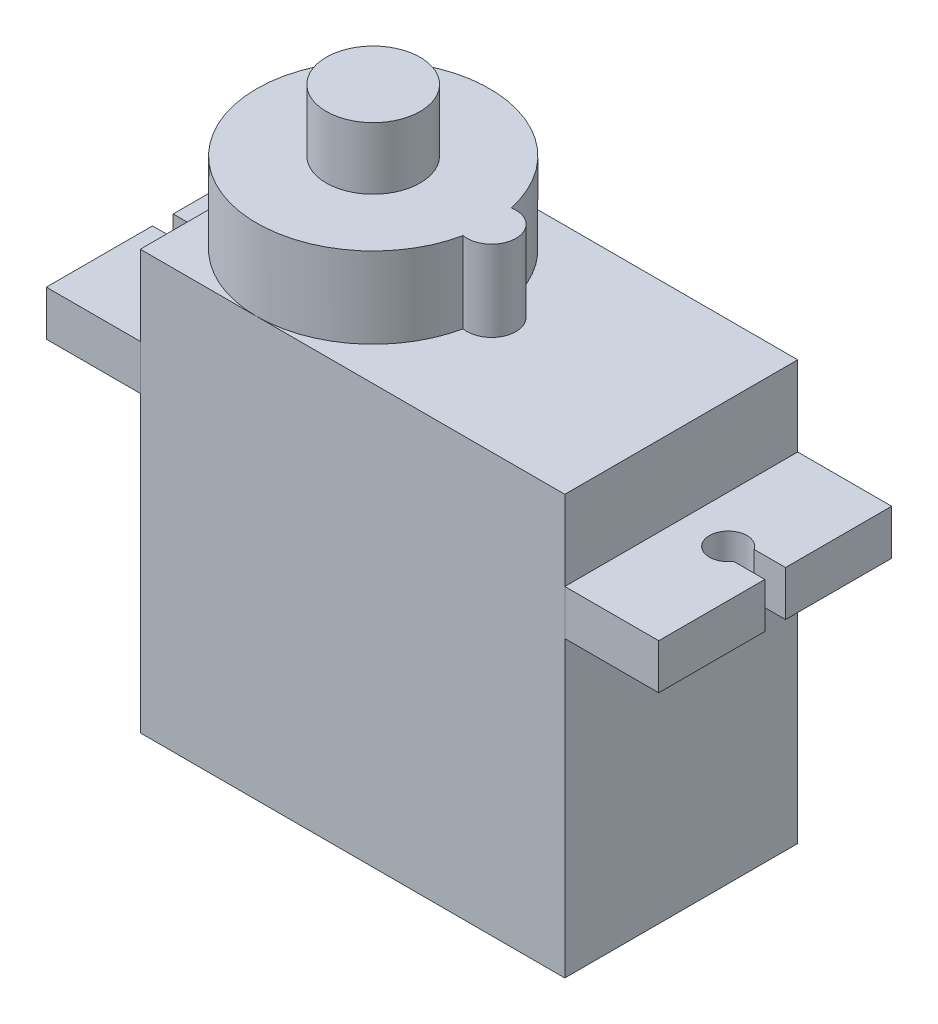
ISO-10303-21;
HEADER;
FILE_DESCRIPTION(('STEP AP214'),'2;1');
FILE_NAME('part.step','',(''),(''),'','','');
FILE_SCHEMA(('AUTOMOTIVE_DESIGN { 1 0 10303 214 1 1 1 1 }'));
ENDSEC;
DATA;
#1=APPLICATION_CONTEXT('core data for automotive mechanical design processes');
#2=APPLICATION_PROTOCOL_DEFINITION('international standard','automotive_design',2000,#1);
#3=PRODUCT_CONTEXT('',#1,'mechanical');
#4=PRODUCT('Part','Part','',(#3));
#5=PRODUCT_RELATED_PRODUCT_CATEGORY('part','',(#4));
#6=PRODUCT_DEFINITION_FORMATION('','',#4);
#7=PRODUCT_DEFINITION_CONTEXT('part definition',#1,'design');
#8=PRODUCT_DEFINITION('design','',#6,#7);
#9=PRODUCT_DEFINITION_SHAPE('','',#8);
#10=(LENGTH_UNIT() NAMED_UNIT(*) SI_UNIT(.MILLI.,.METRE.));
#11=(NAMED_UNIT(*) PLANE_ANGLE_UNIT() SI_UNIT($,.RADIAN.));
#12=(NAMED_UNIT(*) SI_UNIT($,.STERADIAN.) SOLID_ANGLE_UNIT());
#13=UNCERTAINTY_MEASURE_WITH_UNIT(LENGTH_MEASURE(1.E-05),#10,'distance_accuracy_value','');
#14=(GEOMETRIC_REPRESENTATION_CONTEXT(3) GLOBAL_UNCERTAINTY_ASSIGNED_CONTEXT((#13)) GLOBAL_UNIT_ASSIGNED_CONTEXT((#10,
#11,#12)) REPRESENTATION_CONTEXT('',''));
#15=CARTESIAN_POINT('',(0.,0.,0.));
#16=DIRECTION('',(0.,0.,1.));
#17=DIRECTION('',(1.,0.,0.));
#18=AXIS2_PLACEMENT_3D('',#15,#16,#17);
#19=CARTESIAN_POINT('',(-13.6,4.5,1.2));
#20=DIRECTION('',(1.,0.,0.));
#21=DIRECTION('',(0.,0.,-1.));
#22=AXIS2_PLACEMENT_3D('',#19,#20,#21);
#23=CYLINDRICAL_SURFACE('',#22,0.6);
#24=CARTESIAN_POINT('',(-13.6,4.5,1.2));
#25=DIRECTION('',(-1.,0.,0.));
#26=DIRECTION('',(0.,0.,1.));
#27=AXIS2_PLACEMENT_3D('',#24,#25,#26);
#28=CIRCLE('',#27,0.6);
#29=CARTESIAN_POINT('',(-13.6,4.5,1.8));
#30=VERTEX_POINT('',#29);
#31=EDGE_CURVE('E12',#30,#30,#28,.T.);
#32=ORIENTED_EDGE('',*,*,#31,.F.);
#33=EDGE_LOOP('',(#32));
#34=FACE_BOUND('',#33,.T.);
#35=CARTESIAN_POINT('',(-11.3,4.5,1.2));
#36=DIRECTION('',(-1.,0.,0.));
#37=DIRECTION('',(0.,0.,1.));
#38=AXIS2_PLACEMENT_3D('',#35,#36,#37);
#39=CIRCLE('',#38,0.6);
#40=CARTESIAN_POINT('',(-11.3,4.5,1.8));
#41=VERTEX_POINT('',#40);
#42=EDGE_CURVE('E53',#41,#41,#39,.T.);
#43=ORIENTED_EDGE('',*,*,#42,.T.);
#44=EDGE_LOOP('',(#43));
#45=FACE_BOUND('',#44,.T.);
#46=ADVANCED_FACE('F50',(#34,#45),#23,.T.);
#47=CARTESIAN_POINT('',(-13.6,0.,0.));
#48=DIRECTION('',(-1.,0.,0.));
#49=DIRECTION('',(0.,0.,1.));
#50=AXIS2_PLACEMENT_3D('',#47,#48,#49);
#51=PLANE('',#50);
#52=ORIENTED_EDGE('',*,*,#31,.T.);
#53=EDGE_LOOP('',(#52));
#54=FACE_BOUND('',#53,.T.);
#55=ADVANCED_FACE('F65',(#54),#51,.T.);
#56=CARTESIAN_POINT('',(-11.3,0.,0.));
#57=DIRECTION('',(-1.,0.,0.));
#58=DIRECTION('',(0.,0.,1.));
#59=AXIS2_PLACEMENT_3D('',#56,#57,#58);
#60=PLANE('',#59);
#61=ORIENTED_EDGE('',*,*,#42,.F.);
#62=EDGE_LOOP('',(#61));
#63=FACE_BOUND('',#62,.T.);
#64=ADVANCED_FACE('F63',(#63),#60,.F.);
#65=CLOSED_SHELL('',(#46,#55,#64));
#66=MANIFOLD_SOLID_BREP('B2',#65);
#67=CARTESIAN_POINT('',(-13.6,4.5,-1.2));
#68=DIRECTION('',(1.,0.,0.));
#69=DIRECTION('',(0.,0.,-1.));
#70=AXIS2_PLACEMENT_3D('',#67,#68,#69);
#71=CYLINDRICAL_SURFACE('',#70,0.6);
#72=CARTESIAN_POINT('',(-13.6,4.5,-1.2));
#73=DIRECTION('',(-1.,0.,0.));
#74=DIRECTION('',(0.,0.,1.));
#75=AXIS2_PLACEMENT_3D('',#72,#73,#74);
#76=CIRCLE('',#75,0.6);
#77=CARTESIAN_POINT('',(-13.6,4.5,-0.600000000000001));
#78=VERTEX_POINT('',#77);
#79=EDGE_CURVE('E49',#78,#78,#76,.T.);
#80=ORIENTED_EDGE('',*,*,#79,.F.);
#81=EDGE_LOOP('',(#80));
#82=FACE_BOUND('',#81,.T.);
#83=CARTESIAN_POINT('',(-11.3,4.5,-1.2));
#84=DIRECTION('',(-1.,0.,0.));
#85=DIRECTION('',(0.,0.,1.));
#86=AXIS2_PLACEMENT_3D('',#83,#84,#85);
#87=CIRCLE('',#86,0.6);
#88=CARTESIAN_POINT('',(-11.3,4.5,-0.600000000000001));
#89=VERTEX_POINT('',#88);
#90=EDGE_CURVE('E106',#89,#89,#87,.T.);
#91=ORIENTED_EDGE('',*,*,#90,.T.);
#92=EDGE_LOOP('',(#91));
#93=FACE_BOUND('',#92,.T.);
#94=ADVANCED_FACE('F103',(#82,#93),#71,.T.);
#95=CARTESIAN_POINT('',(-13.6,0.,0.));
#96=DIRECTION('',(-1.,0.,0.));
#97=DIRECTION('',(0.,0.,1.));
#98=AXIS2_PLACEMENT_3D('',#95,#96,#97);
#99=PLANE('',#98);
#100=ORIENTED_EDGE('',*,*,#79,.T.);
#101=EDGE_LOOP('',(#100));
#102=FACE_BOUND('',#101,.T.);
#103=ADVANCED_FACE('F118',(#102),#99,.T.);
#104=CARTESIAN_POINT('',(-11.3,0.,0.));
#105=DIRECTION('',(-1.,0.,0.));
#106=DIRECTION('',(0.,0.,1.));
#107=AXIS2_PLACEMENT_3D('',#104,#105,#106);
#108=PLANE('',#107);
#109=ORIENTED_EDGE('',*,*,#90,.F.);
#110=EDGE_LOOP('',(#109));
#111=FACE_BOUND('',#110,.T.);
#112=ADVANCED_FACE('F116',(#111),#108,.F.);
#113=CLOSED_SHELL('',(#94,#103,#112));
#114=MANIFOLD_SOLID_BREP('B7',#113);
#115=CARTESIAN_POINT('',(-13.6,4.5,0.));
#116=DIRECTION('',(1.,0.,0.));
#117=DIRECTION('',(0.,0.,-1.));
#118=AXIS2_PLACEMENT_3D('',#115,#116,#117);
#119=CYLINDRICAL_SURFACE('',#118,0.6);
#120=CARTESIAN_POINT('',(-13.6,4.5,0.));
#121=DIRECTION('',(-1.,0.,0.));
#122=DIRECTION('',(0.,0.,1.));
#123=AXIS2_PLACEMENT_3D('',#120,#121,#122);
#124=CIRCLE('',#123,0.6);
#125=CARTESIAN_POINT('',(-13.6,4.5,0.599999999999999));
#126=VERTEX_POINT('',#125);
#127=EDGE_CURVE('E102',#126,#126,#124,.T.);
#128=ORIENTED_EDGE('',*,*,#127,.F.);
#129=EDGE_LOOP('',(#128));
#130=FACE_BOUND('',#129,.T.);
#131=CARTESIAN_POINT('',(-11.3,4.5,0.));
#132=DIRECTION('',(-1.,0.,0.));
#133=DIRECTION('',(0.,0.,1.));
#134=AXIS2_PLACEMENT_3D('',#131,#132,#133);
#135=CIRCLE('',#134,0.6);
#136=CARTESIAN_POINT('',(-11.3,4.5,0.599999999999999));
#137=VERTEX_POINT('',#136);
#138=EDGE_CURVE('E161',#137,#137,#135,.T.);
#139=ORIENTED_EDGE('',*,*,#138,.T.);
#140=EDGE_LOOP('',(#139));
#141=FACE_BOUND('',#140,.T.);
#142=ADVANCED_FACE('F158',(#130,#141),#119,.T.);
#143=CARTESIAN_POINT('',(-13.6,0.,0.));
#144=DIRECTION('',(-1.,0.,0.));
#145=DIRECTION('',(0.,0.,1.));
#146=AXIS2_PLACEMENT_3D('',#143,#144,#145);
#147=PLANE('',#146);
#148=ORIENTED_EDGE('',*,*,#127,.T.);
#149=EDGE_LOOP('',(#148));
#150=FACE_BOUND('',#149,.T.);
#151=ADVANCED_FACE('F173',(#150),#147,.T.);
#152=CARTESIAN_POINT('',(-11.3,0.,0.));
#153=DIRECTION('',(-1.,0.,0.));
#154=DIRECTION('',(0.,0.,1.));
#155=AXIS2_PLACEMENT_3D('',#152,#153,#154);
#156=PLANE('',#155);
#157=ORIENTED_EDGE('',*,*,#138,.F.);
#158=EDGE_LOOP('',(#157));
#159=FACE_BOUND('',#158,.T.);
#160=ADVANCED_FACE('F171',(#159),#156,.F.);
#161=CLOSED_SHELL('',(#142,#151,#160));
#162=MANIFOLD_SOLID_BREP('B44',#161);
#163=CARTESIAN_POINT('',(-16.3,0.,0.));
#164=DIRECTION('',(-1.,0.,0.));
#165=DIRECTION('',(0.,0.,1.));
#166=AXIS2_PLACEMENT_3D('',#163,#164,#165);
#167=PLANE('',#166);
#168=DIRECTION('',(0.,1.,0.));
#169=VECTOR('',#168,1.);
#170=CARTESIAN_POINT('',(-16.3,-0.001000000000001,-0.55));
#171=LINE('',#170,#169);
#172=CARTESIAN_POINT('',(-16.3,15.65,-0.55));
#173=VERTEX_POINT('',#172);
#174=CARTESIAN_POINT('',(-16.3,18.05,-0.55));
#175=VERTEX_POINT('',#174);
#176=EDGE_CURVE('E343',#173,#175,#171,.T.);
#177=ORIENTED_EDGE('',*,*,#176,.T.);
#178=DIRECTION('',(0.,0.,-1.));
#179=VECTOR('',#178,1.);
#180=CARTESIAN_POINT('',(-16.3,18.05,6.2));
#181=LINE('',#180,#179);
#182=CARTESIAN_POINT('',(-16.3,18.05,-6.2));
#183=VERTEX_POINT('',#182);
#184=EDGE_CURVE('E266',#175,#183,#181,.T.);
#185=ORIENTED_EDGE('',*,*,#184,.T.);
#186=DIRECTION('',(0.,-1.,0.));
#187=VECTOR('',#186,1.);
#188=CARTESIAN_POINT('',(-16.3,18.05,-6.2));
#189=LINE('',#188,#187);
#190=CARTESIAN_POINT('',(-16.3,15.65,-6.2));
#191=VERTEX_POINT('',#190);
#192=EDGE_CURVE('E305',#183,#191,#189,.T.);
#193=ORIENTED_EDGE('',*,*,#192,.T.);
#194=DIRECTION('',(0.,0.,1.));
#195=VECTOR('',#194,1.);
#196=CARTESIAN_POINT('',(-16.3,15.65,-6.2));
#197=LINE('',#196,#195);
#198=EDGE_CURVE('E311',#191,#173,#197,.T.);
#199=ORIENTED_EDGE('',*,*,#198,.T.);
#200=EDGE_LOOP('',(#177,#185,#193,#199));
#201=FACE_BOUND('',#200,.T.);
#202=ADVANCED_FACE('F213',(#201),#167,.T.);
#203=CARTESIAN_POINT('',(-16.3,18.05,6.2));
#204=DIRECTION('',(0.,-1.,0.));
#205=DIRECTION('',(0.,0.,-1.));
#206=AXIS2_PLACEMENT_3D('',#203,#204,#205);
#207=PLANE('',#206);
#208=ORIENTED_EDGE('',*,*,#184,.F.);
#209=DIRECTION('',(-1.,0.,0.));
#210=VECTOR('',#209,1.);
#211=CARTESIAN_POINT('',(-16.3,18.05,-0.55));
#212=LINE('',#211,#210);
#213=CARTESIAN_POINT('',(-14.6351646544245,18.05,-0.55));
#214=VERTEX_POINT('',#213);
#215=EDGE_CURVE('E294',#214,#175,#212,.T.);
#216=ORIENTED_EDGE('',*,*,#215,.F.);
#217=CARTESIAN_POINT('',(-13.8,18.05,0.));
#218=DIRECTION('',(0.,1.,0.));
#219=DIRECTION('',(0.,0.,1.));
#220=AXIS2_PLACEMENT_3D('',#217,#218,#219);
#221=CIRCLE('',#220,1.);
#222=CARTESIAN_POINT('',(-14.6351646544245,18.05,0.55));
#223=VERTEX_POINT('',#222);
#224=EDGE_CURVE('E301',#223,#214,#221,.T.);
#225=ORIENTED_EDGE('',*,*,#224,.F.);
#226=DIRECTION('',(1.,0.,0.));
#227=VECTOR('',#226,1.);
#228=CARTESIAN_POINT('',(-16.3,18.05,0.55));
#229=LINE('',#228,#227);
#230=CARTESIAN_POINT('',(-16.3,18.05,0.55));
#231=VERTEX_POINT('',#230);
#232=EDGE_CURVE('E290',#231,#223,#229,.T.);
#233=ORIENTED_EDGE('',*,*,#232,.F.);
#234=CARTESIAN_POINT('',(-16.3,18.05,6.2));
#235=VERTEX_POINT('',#234);
#236=EDGE_CURVE('E298',#235,#231,#181,.T.);
#237=ORIENTED_EDGE('',*,*,#236,.F.);
#238=DIRECTION('',(1.,0.,0.));
#239=VECTOR('',#238,1.);
#240=CARTESIAN_POINT('',(-16.3,18.05,6.2));
#241=LINE('',#240,#239);
#242=CARTESIAN_POINT('',(-11.3,18.05,6.2));
#243=VERTEX_POINT('',#242);
#244=EDGE_CURVE('E315',#235,#243,#241,.T.);
#245=ORIENTED_EDGE('',*,*,#244,.T.);
#246=DIRECTION('',(0.,0.,-1.));
#247=VECTOR('',#246,1.);
#248=CARTESIAN_POINT('',(-11.3,18.05,6.2));
#249=LINE('',#248,#247);
#250=CARTESIAN_POINT('',(-11.3,18.05,-6.2));
#251=VERTEX_POINT('',#250);
#252=EDGE_CURVE('E316',#243,#251,#249,.T.);
#253=ORIENTED_EDGE('',*,*,#252,.T.);
#254=DIRECTION('',(1.,0.,0.));
#255=VECTOR('',#254,1.);
#256=CARTESIAN_POINT('',(-16.3,18.05,-6.2));
#257=LINE('',#256,#255);
#258=EDGE_CURVE('E156',#183,#251,#257,.T.);
#259=ORIENTED_EDGE('',*,*,#258,.F.);
#260=EDGE_LOOP('',(#208,#216,#225,#233,#237,#245,#253,#259));
#261=FACE_BOUND('',#260,.T.);
#262=ADVANCED_FACE('F215',(#261),#207,.F.);
#263=CARTESIAN_POINT('',(-16.3,18.05,-6.2));
#264=DIRECTION('',(0.,0.,1.));
#265=DIRECTION('',(1.,0.,0.));
#266=AXIS2_PLACEMENT_3D('',#263,#264,#265);
#267=PLANE('',#266);
#268=DIRECTION('',(0.,-1.,0.));
#269=VECTOR('',#268,1.);
#270=CARTESIAN_POINT('',(-11.3,18.05,-6.2));
#271=LINE('',#270,#269);
#272=CARTESIAN_POINT('',(-11.3,15.65,-6.2));
#273=VERTEX_POINT('',#272);
#274=EDGE_CURVE('E319',#251,#273,#271,.T.);
#275=ORIENTED_EDGE('',*,*,#274,.T.);
#276=DIRECTION('',(1.,0.,0.));
#277=VECTOR('',#276,1.);
#278=CARTESIAN_POINT('',(-16.3,15.65,-6.2));
#279=LINE('',#278,#277);
#280=EDGE_CURVE('E221',#191,#273,#279,.T.);
#281=ORIENTED_EDGE('',*,*,#280,.F.);
#282=ORIENTED_EDGE('',*,*,#192,.F.);
#283=ORIENTED_EDGE('',*,*,#258,.T.);
#284=EDGE_LOOP('',(#275,#281,#282,#283));
#285=FACE_BOUND('',#284,.T.);
#286=ADVANCED_FACE('F357',(#285),#267,.F.);
#287=CARTESIAN_POINT('',(-16.3,15.65,-6.2));
#288=DIRECTION('',(0.,1.,0.));
#289=DIRECTION('',(0.,0.,1.));
#290=AXIS2_PLACEMENT_3D('',#287,#288,#289);
#291=PLANE('',#290);
#292=CARTESIAN_POINT('',(-13.8,15.65,0.));
#293=DIRECTION('',(0.,1.,0.));
#294=DIRECTION('',(0.,0.,1.));
#295=AXIS2_PLACEMENT_3D('',#292,#293,#294);
#296=CIRCLE('',#295,1.);
#297=CARTESIAN_POINT('',(-14.6351646544245,15.65,-0.55));
#298=VERTEX_POINT('',#297);
#299=CARTESIAN_POINT('',(-14.6351646544245,15.65,0.55));
#300=VERTEX_POINT('',#299);
#301=EDGE_CURVE('E342',#298,#300,#296,.F.);
#302=ORIENTED_EDGE('',*,*,#301,.F.);
#303=DIRECTION('',(1.,0.,0.));
#304=VECTOR('',#303,1.);
#305=CARTESIAN_POINT('',(-16.3,15.65,-0.55));
#306=LINE('',#305,#304);
#307=EDGE_CURVE('E302',#173,#298,#306,.T.);
#308=ORIENTED_EDGE('',*,*,#307,.F.);
#309=ORIENTED_EDGE('',*,*,#198,.F.);
#310=ORIENTED_EDGE('',*,*,#280,.T.);
#311=DIRECTION('',(0.,0.,1.));
#312=VECTOR('',#311,1.);
#313=CARTESIAN_POINT('',(-11.3,15.65,-6.2));
#314=LINE('',#313,#312);
#315=CARTESIAN_POINT('',(-11.3,15.65,6.2));
#316=VERTEX_POINT('',#315);
#317=EDGE_CURVE('E321',#273,#316,#314,.T.);
#318=ORIENTED_EDGE('',*,*,#317,.T.);
#319=DIRECTION('',(1.,0.,0.));
#320=VECTOR('',#319,1.);
#321=CARTESIAN_POINT('',(-16.3,15.65,6.2));
#322=LINE('',#321,#320);
#323=CARTESIAN_POINT('',(-16.3,15.65,6.2));
#324=VERTEX_POINT('',#323);
#325=EDGE_CURVE('E325',#324,#316,#322,.T.);
#326=ORIENTED_EDGE('',*,*,#325,.F.);
#327=CARTESIAN_POINT('',(-16.3,15.65,0.549999999999997));
#328=VERTEX_POINT('',#327);
#329=EDGE_CURVE('E307',#328,#324,#197,.T.);
#330=ORIENTED_EDGE('',*,*,#329,.F.);
#331=DIRECTION('',(-1.,0.,0.));
#332=VECTOR('',#331,1.);
#333=CARTESIAN_POINT('',(-16.3,15.65,0.55));
#334=LINE('',#333,#332);
#335=EDGE_CURVE('E228',#300,#328,#334,.T.);
#336=ORIENTED_EDGE('',*,*,#335,.F.);
#337=EDGE_LOOP('',(#302,#308,#309,#310,#318,#326,#330,#336));
#338=FACE_BOUND('',#337,.T.);
#339=ADVANCED_FACE('F332',(#338),#291,.F.);
#340=CARTESIAN_POINT('',(-16.3,15.65,6.2));
#341=DIRECTION('',(0.,0.,-1.));
#342=DIRECTION('',(-1.,0.,0.));
#343=AXIS2_PLACEMENT_3D('',#340,#341,#342);
#344=PLANE('',#343);
#345=DIRECTION('',(0.,1.,0.));
#346=VECTOR('',#345,1.);
#347=CARTESIAN_POINT('',(-11.3,15.65,6.2));
#348=LINE('',#347,#346);
#349=EDGE_CURVE('E258',#316,#243,#348,.T.);
#350=ORIENTED_EDGE('',*,*,#349,.T.);
#351=ORIENTED_EDGE('',*,*,#244,.F.);
#352=DIRECTION('',(0.,1.,0.));
#353=VECTOR('',#352,1.);
#354=CARTESIAN_POINT('',(-16.3,15.65,6.2));
#355=LINE('',#354,#353);
#356=EDGE_CURVE('E237',#324,#235,#355,.T.);
#357=ORIENTED_EDGE('',*,*,#356,.F.);
#358=ORIENTED_EDGE('',*,*,#325,.T.);
#359=EDGE_LOOP('',(#350,#351,#357,#358));
#360=FACE_BOUND('',#359,.T.);
#361=ADVANCED_FACE('F340',(#360),#344,.F.);
#362=DIRECTION('',(0.,1.,0.));
#363=VECTOR('',#362,1.);
#364=CARTESIAN_POINT('',(-16.3,-0.001000000000001,0.55));
#365=LINE('',#364,#363);
#366=EDGE_CURVE('E287',#328,#231,#365,.T.);
#367=ORIENTED_EDGE('',*,*,#366,.F.);
#368=ORIENTED_EDGE('',*,*,#329,.T.);
#369=ORIENTED_EDGE('',*,*,#356,.T.);
#370=ORIENTED_EDGE('',*,*,#236,.T.);
#371=EDGE_LOOP('',(#367,#368,#369,#370));
#372=FACE_BOUND('',#371,.T.);
#373=ADVANCED_FACE('F304',(#372),#167,.T.);
#374=CARTESIAN_POINT('',(-11.3,0.,0.));
#375=DIRECTION('',(-1.,0.,0.));
#376=DIRECTION('',(0.,0.,1.));
#377=AXIS2_PLACEMENT_3D('',#374,#375,#376);
#378=PLANE('',#377);
#379=ORIENTED_EDGE('',*,*,#252,.F.);
#380=ORIENTED_EDGE('',*,*,#349,.F.);
#381=ORIENTED_EDGE('',*,*,#317,.F.);
#382=ORIENTED_EDGE('',*,*,#274,.F.);
#383=EDGE_LOOP('',(#379,#380,#381,#382));
#384=FACE_BOUND('',#383,.T.);
#385=ADVANCED_FACE('F338',(#384),#378,.F.);
#386=CARTESIAN_POINT('',(-16.3,-0.001000000000001,-0.55));
#387=DIRECTION('',(0.,0.,-1.));
#388=DIRECTION('',(-1.,0.,0.));
#389=AXIS2_PLACEMENT_3D('',#386,#387,#388);
#390=PLANE('',#389);
#391=ORIENTED_EDGE('',*,*,#307,.T.);
#392=DIRECTION('',(0.,1.,0.));
#393=VECTOR('',#392,1.);
#394=CARTESIAN_POINT('',(-14.6351646544245,-0.001000000000001,-0.55));
#395=LINE('',#394,#393);
#396=EDGE_CURVE('E344',#298,#214,#395,.T.);
#397=ORIENTED_EDGE('',*,*,#396,.T.);
#398=ORIENTED_EDGE('',*,*,#215,.T.);
#399=ORIENTED_EDGE('',*,*,#176,.F.);
#400=EDGE_LOOP('',(#391,#397,#398,#399));
#401=FACE_BOUND('',#400,.T.);
#402=ADVANCED_FACE('F356',(#401),#390,.F.);
#403=CARTESIAN_POINT('',(-13.8,-0.001000000000001,0.));
#404=DIRECTION('',(0.,1.,0.));
#405=DIRECTION('',(0.,0.,1.));
#406=AXIS2_PLACEMENT_3D('',#403,#404,#405);
#407=CYLINDRICAL_SURFACE('',#406,1.);
#408=ORIENTED_EDGE('',*,*,#301,.T.);
#409=DIRECTION('',(0.,1.,0.));
#410=VECTOR('',#409,1.);
#411=CARTESIAN_POINT('',(-14.6351646544245,-0.001000000000001,0.55));
#412=LINE('',#411,#410);
#413=EDGE_CURVE('E293',#300,#223,#412,.T.);
#414=ORIENTED_EDGE('',*,*,#413,.T.);
#415=ORIENTED_EDGE('',*,*,#224,.T.);
#416=ORIENTED_EDGE('',*,*,#396,.F.);
#417=EDGE_LOOP('',(#408,#414,#415,#416));
#418=FACE_BOUND('',#417,.T.);
#419=ADVANCED_FACE('F351',(#418),#407,.F.);
#420=CARTESIAN_POINT('',(-16.3,-0.001000000000001,0.55));
#421=DIRECTION('',(0.,0.,1.));
#422=DIRECTION('',(1.,0.,0.));
#423=AXIS2_PLACEMENT_3D('',#420,#421,#422);
#424=PLANE('',#423);
#425=ORIENTED_EDGE('',*,*,#335,.T.);
#426=ORIENTED_EDGE('',*,*,#366,.T.);
#427=ORIENTED_EDGE('',*,*,#232,.T.);
#428=ORIENTED_EDGE('',*,*,#413,.F.);
#429=EDGE_LOOP('',(#425,#426,#427,#428));
#430=FACE_BOUND('',#429,.T.);
#431=ADVANCED_FACE('F289',(#430),#424,.F.);
#432=CLOSED_SHELL('',(#202,#262,#286,#339,#361,#373,#385,#402,#419,#431));
#433=MANIFOLD_SOLID_BREP('B97',#432);
#434=CARTESIAN_POINT('',(16.3,15.65,6.2));
#435=DIRECTION('',(0.,1.,0.));
#436=DIRECTION('',(0.,0.,1.));
#437=AXIS2_PLACEMENT_3D('',#434,#435,#436);
#438=PLANE('',#437);
#439=DIRECTION('',(-1.,0.,0.));
#440=VECTOR('',#439,1.);
#441=CARTESIAN_POINT('',(14.6351646544245,15.65,-0.55));
#442=LINE('',#441,#440);
#443=CARTESIAN_POINT('',(16.3,15.65,-0.55));
#444=VERTEX_POINT('',#443);
#445=CARTESIAN_POINT('',(14.6351646544245,15.65,-0.55));
#446=VERTEX_POINT('',#445);
#447=EDGE_CURVE('E539',#444,#446,#442,.T.);
#448=ORIENTED_EDGE('',*,*,#447,.T.);
#449=CARTESIAN_POINT('',(13.8,15.65,0.));
#450=DIRECTION('',(0.,1.,0.));
#451=DIRECTION('',(0.,0.,1.));
#452=AXIS2_PLACEMENT_3D('',#449,#450,#451);
#453=CIRCLE('',#452,1.);
#454=CARTESIAN_POINT('',(14.6351646544245,15.65,0.55));
#455=VERTEX_POINT('',#454);
#456=EDGE_CURVE('E526',#455,#446,#453,.F.);
#457=ORIENTED_EDGE('',*,*,#456,.F.);
#458=DIRECTION('',(-1.,0.,0.));
#459=VECTOR('',#458,1.);
#460=CARTESIAN_POINT('',(14.6351646544245,15.65,0.55));
#461=LINE('',#460,#459);
#462=CARTESIAN_POINT('',(16.3,15.65,0.55));
#463=VERTEX_POINT('',#462);
#464=EDGE_CURVE('E533',#463,#455,#461,.T.);
#465=ORIENTED_EDGE('',*,*,#464,.F.);
#466=DIRECTION('',(0.,0.,-1.));
#467=VECTOR('',#466,1.);
#468=CARTESIAN_POINT('',(16.3,15.65,6.2));
#469=LINE('',#468,#467);
#470=CARTESIAN_POINT('',(16.3,15.65,6.2));
#471=VERTEX_POINT('',#470);
#472=EDGE_CURVE('E499',#471,#463,#469,.T.);
#473=ORIENTED_EDGE('',*,*,#472,.F.);
#474=DIRECTION('',(-1.,0.,0.));
#475=VECTOR('',#474,1.);
#476=CARTESIAN_POINT('',(16.3,15.65,6.2));
#477=LINE('',#476,#475);
#478=CARTESIAN_POINT('',(11.3,15.65,6.2));
#479=VERTEX_POINT('',#478);
#480=EDGE_CURVE('E211',#471,#479,#477,.T.);
#481=ORIENTED_EDGE('',*,*,#480,.T.);
#482=DIRECTION('',(0.,0.,-1.));
#483=VECTOR('',#482,1.);
#484=CARTESIAN_POINT('',(11.3,15.65,6.2));
#485=LINE('',#484,#483);
#486=CARTESIAN_POINT('',(11.3,15.65,-6.2));
#487=VERTEX_POINT('',#486);
#488=EDGE_CURVE('E563',#479,#487,#485,.T.);
#489=ORIENTED_EDGE('',*,*,#488,.T.);
#490=DIRECTION('',(-1.,0.,0.));
#491=VECTOR('',#490,1.);
#492=CARTESIAN_POINT('',(16.3,15.65,-6.2));
#493=LINE('',#492,#491);
#494=CARTESIAN_POINT('',(16.3,15.65,-6.2));
#495=VERTEX_POINT('',#494);
#496=EDGE_CURVE('E455',#495,#487,#493,.T.);
#497=ORIENTED_EDGE('',*,*,#496,.F.);
#498=EDGE_CURVE('E553',#444,#495,#469,.T.);
#499=ORIENTED_EDGE('',*,*,#498,.F.);
#500=EDGE_LOOP('',(#448,#457,#465,#473,#481,#489,#497,#499));
#501=FACE_BOUND('',#500,.T.);
#502=ADVANCED_FACE('F447',(#501),#438,.F.);
#503=CARTESIAN_POINT('',(16.3,18.05,6.2));
#504=DIRECTION('',(0.,-1.,0.));
#505=DIRECTION('',(0.,0.,-1.));
#506=AXIS2_PLACEMENT_3D('',#503,#504,#505);
#507=PLANE('',#506);
#508=DIRECTION('',(1.,0.,0.));
#509=VECTOR('',#508,1.);
#510=CARTESIAN_POINT('',(14.6351646544245,18.05,-0.55));
#511=LINE('',#510,#509);
#512=CARTESIAN_POINT('',(14.6351646544245,18.05,-0.55));
#513=VERTEX_POINT('',#512);
#514=CARTESIAN_POINT('',(16.3,18.05,-0.55));
#515=VERTEX_POINT('',#514);
#516=EDGE_CURVE('E531',#513,#515,#511,.T.);
#517=ORIENTED_EDGE('',*,*,#516,.T.);
#518=DIRECTION('',(0.,0.,1.));
#519=VECTOR('',#518,1.);
#520=CARTESIAN_POINT('',(16.3,18.05,6.2));
#521=LINE('',#520,#519);
#522=CARTESIAN_POINT('',(16.3,18.05,-6.2));
#523=VERTEX_POINT('',#522);
#524=EDGE_CURVE('E557',#523,#515,#521,.T.);
#525=ORIENTED_EDGE('',*,*,#524,.F.);
#526=DIRECTION('',(-1.,0.,0.));
#527=VECTOR('',#526,1.);
#528=CARTESIAN_POINT('',(16.3,18.05,-6.2));
#529=LINE('',#528,#527);
#530=CARTESIAN_POINT('',(11.3,18.05,-6.2));
#531=VERTEX_POINT('',#530);
#532=EDGE_CURVE('E569',#523,#531,#529,.T.);
#533=ORIENTED_EDGE('',*,*,#532,.T.);
#534=DIRECTION('',(0.,0.,1.));
#535=VECTOR('',#534,1.);
#536=CARTESIAN_POINT('',(11.3,18.05,6.2));
#537=LINE('',#536,#535);
#538=CARTESIAN_POINT('',(11.3,18.05,6.2));
#539=VERTEX_POINT('',#538);
#540=EDGE_CURVE('E492',#531,#539,#537,.T.);
#541=ORIENTED_EDGE('',*,*,#540,.T.);
#542=DIRECTION('',(-1.,0.,0.));
#543=VECTOR('',#542,1.);
#544=CARTESIAN_POINT('',(16.3,18.05,6.2));
#545=LINE('',#544,#543);
#546=CARTESIAN_POINT('',(16.3,18.05,6.2));
#547=VERTEX_POINT('',#546);
#548=EDGE_CURVE('E560',#547,#539,#545,.T.);
#549=ORIENTED_EDGE('',*,*,#548,.F.);
#550=CARTESIAN_POINT('',(16.3,18.05,0.550000000000002));
#551=VERTEX_POINT('',#550);
#552=EDGE_CURVE('E470',#551,#547,#521,.T.);
#553=ORIENTED_EDGE('',*,*,#552,.F.);
#554=DIRECTION('',(1.,0.,0.));
#555=VECTOR('',#554,1.);
#556=CARTESIAN_POINT('',(14.6351646544245,18.05,0.55));
#557=LINE('',#556,#555);
#558=CARTESIAN_POINT('',(14.6351646544245,18.05,0.55));
#559=VERTEX_POINT('',#558);
#560=EDGE_CURVE('E462',#559,#551,#557,.T.);
#561=ORIENTED_EDGE('',*,*,#560,.F.);
#562=CARTESIAN_POINT('',(13.8,18.05,0.));
#563=DIRECTION('',(0.,1.,0.));
#564=DIRECTION('',(0.,0.,1.));
#565=AXIS2_PLACEMENT_3D('',#562,#563,#564);
#566=CIRCLE('',#565,1.);
#567=EDGE_CURVE('E529',#513,#559,#566,.T.);
#568=ORIENTED_EDGE('',*,*,#567,.F.);
#569=EDGE_LOOP('',(#517,#525,#533,#541,#549,#553,#561,#568));
#570=FACE_BOUND('',#569,.T.);
#571=ADVANCED_FACE('F583',(#570),#507,.F.);
#572=CARTESIAN_POINT('',(16.3,0.,0.));
#573=DIRECTION('',(1.,0.,0.));
#574=DIRECTION('',(0.,0.,-1.));
#575=AXIS2_PLACEMENT_3D('',#572,#573,#574);
#576=PLANE('',#575);
#577=ORIENTED_EDGE('',*,*,#524,.T.);
#578=DIRECTION('',(0.,1.,0.));
#579=VECTOR('',#578,1.);
#580=CARTESIAN_POINT('',(16.3,-0.001000000000001,-0.55));
#581=LINE('',#580,#579);
#582=EDGE_CURVE('E548',#444,#515,#581,.T.);
#583=ORIENTED_EDGE('',*,*,#582,.F.);
#584=ORIENTED_EDGE('',*,*,#498,.T.);
#585=DIRECTION('',(0.,1.,0.));
#586=VECTOR('',#585,1.);
#587=CARTESIAN_POINT('',(16.3,18.05,-6.2));
#588=LINE('',#587,#586);
#589=EDGE_CURVE('E555',#495,#523,#588,.T.);
#590=ORIENTED_EDGE('',*,*,#589,.T.);
#591=EDGE_LOOP('',(#577,#583,#584,#590));
#592=FACE_BOUND('',#591,.T.);
#593=ADVANCED_FACE('F589',(#592),#576,.T.);
#594=CARTESIAN_POINT('',(16.3,18.05,6.2));
#595=DIRECTION('',(0.,0.,-1.));
#596=DIRECTION('',(-1.,0.,0.));
#597=AXIS2_PLACEMENT_3D('',#594,#595,#596);
#598=PLANE('',#597);
#599=DIRECTION('',(0.,-1.,0.));
#600=VECTOR('',#599,1.);
#601=CARTESIAN_POINT('',(11.3,18.05,6.2));
#602=LINE('',#601,#600);
#603=EDGE_CURVE('E535',#539,#479,#602,.T.);
#604=ORIENTED_EDGE('',*,*,#603,.T.);
#605=ORIENTED_EDGE('',*,*,#480,.F.);
#606=DIRECTION('',(0.,-1.,0.));
#607=VECTOR('',#606,1.);
#608=CARTESIAN_POINT('',(16.3,18.05,6.2));
#609=LINE('',#608,#607);
#610=EDGE_CURVE('E551',#547,#471,#609,.T.);
#611=ORIENTED_EDGE('',*,*,#610,.F.);
#612=ORIENTED_EDGE('',*,*,#548,.T.);
#613=EDGE_LOOP('',(#604,#605,#611,#612));
#614=FACE_BOUND('',#613,.T.);
#615=ADVANCED_FACE('F449',(#614),#598,.F.);
#616=CARTESIAN_POINT('',(16.3,18.05,-6.2));
#617=DIRECTION('',(0.,0.,1.));
#618=DIRECTION('',(1.,0.,0.));
#619=AXIS2_PLACEMENT_3D('',#616,#617,#618);
#620=PLANE('',#619);
#621=DIRECTION('',(0.,1.,0.));
#622=VECTOR('',#621,1.);
#623=CARTESIAN_POINT('',(11.3,18.05,-6.2));
#624=LINE('',#623,#622);
#625=EDGE_CURVE('E565',#487,#531,#624,.T.);
#626=ORIENTED_EDGE('',*,*,#625,.T.);
#627=ORIENTED_EDGE('',*,*,#532,.F.);
#628=ORIENTED_EDGE('',*,*,#589,.F.);
#629=ORIENTED_EDGE('',*,*,#496,.T.);
#630=EDGE_LOOP('',(#626,#627,#628,#629));
#631=FACE_BOUND('',#630,.T.);
#632=ADVANCED_FACE('F575',(#631),#620,.F.);
#633=DIRECTION('',(0.,1.,0.));
#634=VECTOR('',#633,1.);
#635=CARTESIAN_POINT('',(16.3,-0.001000000000001,0.55));
#636=LINE('',#635,#634);
#637=EDGE_CURVE('E530',#463,#551,#636,.T.);
#638=ORIENTED_EDGE('',*,*,#637,.T.);
#639=ORIENTED_EDGE('',*,*,#552,.T.);
#640=ORIENTED_EDGE('',*,*,#610,.T.);
#641=ORIENTED_EDGE('',*,*,#472,.T.);
#642=EDGE_LOOP('',(#638,#639,#640,#641));
#643=FACE_BOUND('',#642,.T.);
#644=ADVANCED_FACE('F606',(#643),#576,.T.);
#645=CARTESIAN_POINT('',(11.3,0.,0.));
#646=DIRECTION('',(1.,0.,0.));
#647=DIRECTION('',(0.,0.,-1.));
#648=AXIS2_PLACEMENT_3D('',#645,#646,#647);
#649=PLANE('',#648);
#650=ORIENTED_EDGE('',*,*,#603,.F.);
#651=ORIENTED_EDGE('',*,*,#540,.F.);
#652=ORIENTED_EDGE('',*,*,#625,.F.);
#653=ORIENTED_EDGE('',*,*,#488,.F.);
#654=EDGE_LOOP('',(#650,#651,#652,#653));
#655=FACE_BOUND('',#654,.T.);
#656=ADVANCED_FACE('F579',(#655),#649,.F.);
#657=CARTESIAN_POINT('',(13.8,-0.001000000000001,0.));
#658=DIRECTION('',(0.,1.,0.));
#659=DIRECTION('',(0.,0.,1.));
#660=AXIS2_PLACEMENT_3D('',#657,#658,#659);
#661=CYLINDRICAL_SURFACE('',#660,1.);
#662=ORIENTED_EDGE('',*,*,#456,.T.);
#663=DIRECTION('',(0.,1.,0.));
#664=VECTOR('',#663,1.);
#665=CARTESIAN_POINT('',(14.6351646544245,-0.001000000000001,-0.55));
#666=LINE('',#665,#664);
#667=EDGE_CURVE('E536',#446,#513,#666,.T.);
#668=ORIENTED_EDGE('',*,*,#667,.T.);
#669=ORIENTED_EDGE('',*,*,#567,.T.);
#670=DIRECTION('',(0.,1.,0.));
#671=VECTOR('',#670,1.);
#672=CARTESIAN_POINT('',(14.6351646544245,-0.001000000000001,0.55));
#673=LINE('',#672,#671);
#674=EDGE_CURVE('E522',#455,#559,#673,.T.);
#675=ORIENTED_EDGE('',*,*,#674,.F.);
#676=EDGE_LOOP('',(#662,#668,#669,#675));
#677=FACE_BOUND('',#676,.T.);
#678=ADVANCED_FACE('F524',(#677),#661,.F.);
#679=CARTESIAN_POINT('',(14.6351646544245,-0.001000000000001,-0.55));
#680=DIRECTION('',(0.,0.,1.));
#681=DIRECTION('',(1.,0.,0.));
#682=AXIS2_PLACEMENT_3D('',#679,#680,#681);
#683=PLANE('',#682);
#684=ORIENTED_EDGE('',*,*,#582,.T.);
#685=ORIENTED_EDGE('',*,*,#516,.F.);
#686=ORIENTED_EDGE('',*,*,#667,.F.);
#687=ORIENTED_EDGE('',*,*,#447,.F.);
#688=EDGE_LOOP('',(#684,#685,#686,#687));
#689=FACE_BOUND('',#688,.T.);
#690=ADVANCED_FACE('F590',(#689),#683,.T.);
#691=CARTESIAN_POINT('',(14.6351646544245,-0.001000000000001,0.55));
#692=DIRECTION('',(0.,0.,1.));
#693=DIRECTION('',(1.,0.,0.));
#694=AXIS2_PLACEMENT_3D('',#691,#692,#693);
#695=PLANE('',#694);
#696=ORIENTED_EDGE('',*,*,#464,.T.);
#697=ORIENTED_EDGE('',*,*,#674,.T.);
#698=ORIENTED_EDGE('',*,*,#560,.T.);
#699=ORIENTED_EDGE('',*,*,#637,.F.);
#700=EDGE_LOOP('',(#696,#697,#698,#699));
#701=FACE_BOUND('',#700,.T.);
#702=ADVANCED_FACE('F534',(#701),#695,.F.);
#703=CLOSED_SHELL('',(#502,#571,#593,#615,#632,#644,#656,#678,#690,#702));
#704=MANIFOLD_SOLID_BREP('B150',#703);
#705=CARTESIAN_POINT('',(0.,22.3,0.));
#706=DIRECTION('',(0.,-1.,0.));
#707=DIRECTION('',(0.,0.,-1.));
#708=AXIS2_PLACEMENT_3D('',#705,#706,#707);
#709=PLANE('',#708);
#710=CARTESIAN_POINT('',(1.2,22.3,0.));
#711=DIRECTION('',(0.,1.,0.));
#712=DIRECTION('',(0.,0.,1.));
#713=AXIS2_PLACEMENT_3D('',#710,#711,#712);
#714=CIRCLE('',#713,1.3);
#715=CARTESIAN_POINT('',(0.966666666666667,22.3,1.27888840621673));
#716=VERTEX_POINT('',#715);
#717=CARTESIAN_POINT('',(0.966666666666667,22.3,-1.27888840621673));
#718=VERTEX_POINT('',#717);
#719=EDGE_CURVE('E751',#716,#718,#714,.T.);
#720=ORIENTED_EDGE('',*,*,#719,.F.);
#721=CARTESIAN_POINT('',(-5.1,22.3,0.));
#722=DIRECTION('',(0.,1.,0.));
#723=DIRECTION('',(0.,0.,1.));
#724=AXIS2_PLACEMENT_3D('',#721,#722,#723);
#725=CIRCLE('',#724,6.2);
#726=CARTESIAN_POINT('',(-5.1,22.3,6.2));
#727=VERTEX_POINT('',#726);
#728=EDGE_CURVE('E695',#727,#716,#725,.T.);
#729=ORIENTED_EDGE('',*,*,#728,.F.);
#730=DIRECTION('',(1.,0.,0.));
#731=VECTOR('',#730,1.);
#732=CARTESIAN_POINT('',(-11.3,22.3,6.2));
#733=LINE('',#732,#731);
#734=CARTESIAN_POINT('',(11.3,22.3,6.2));
#735=VERTEX_POINT('',#734);
#736=EDGE_CURVE('E771',#727,#735,#733,.T.);
#737=ORIENTED_EDGE('',*,*,#736,.T.);
#738=DIRECTION('',(0.,0.,-1.));
#739=VECTOR('',#738,1.);
#740=CARTESIAN_POINT('',(11.3,22.3,6.2));
#741=LINE('',#740,#739);
#742=CARTESIAN_POINT('',(11.3,22.3,-6.2));
#743=VERTEX_POINT('',#742);
#744=EDGE_CURVE('E760',#735,#743,#741,.T.);
#745=ORIENTED_EDGE('',*,*,#744,.T.);
#746=DIRECTION('',(-1.,0.,0.));
#747=VECTOR('',#746,1.);
#748=CARTESIAN_POINT('',(-11.3,22.3,-6.2));
#749=LINE('',#748,#747);
#750=CARTESIAN_POINT('',(-5.1,22.3,-6.2));
#751=VERTEX_POINT('',#750);
#752=EDGE_CURVE('E765',#743,#751,#749,.T.);
#753=ORIENTED_EDGE('',*,*,#752,.T.);
#754=EDGE_CURVE('E689',#718,#751,#725,.T.);
#755=ORIENTED_EDGE('',*,*,#754,.F.);
#756=EDGE_LOOP('',(#720,#729,#737,#745,#753,#755));
#757=FACE_BOUND('',#756,.T.);
#758=ADVANCED_FACE('F672',(#757),#709,.F.);
#759=CARTESIAN_POINT('',(-11.3,22.3,0.));
#760=VERTEX_POINT('',#759);
#761=EDGE_CURVE('E681',#751,#760,#725,.T.);
#762=ORIENTED_EDGE('',*,*,#761,.F.);
#763=CARTESIAN_POINT('',(-11.3,22.3,-6.2));
#764=VERTEX_POINT('',#763);
#765=EDGE_CURVE('E763',#751,#764,#749,.T.);
#766=ORIENTED_EDGE('',*,*,#765,.T.);
#767=DIRECTION('',(0.,0.,1.));
#768=VECTOR('',#767,1.);
#769=CARTESIAN_POINT('',(-11.3,22.3,6.2));
#770=LINE('',#769,#768);
#771=EDGE_CURVE('E768',#764,#760,#770,.T.);
#772=ORIENTED_EDGE('',*,*,#771,.T.);
#773=EDGE_LOOP('',(#762,#766,#772));
#774=FACE_BOUND('',#773,.T.);
#775=ADVANCED_FACE('F800',(#774),#709,.F.);
#776=CARTESIAN_POINT('',(11.3,22.3,6.2));
#777=DIRECTION('',(-1.,0.,0.));
#778=DIRECTION('',(0.,0.,1.));
#779=AXIS2_PLACEMENT_3D('',#776,#777,#778);
#780=PLANE('',#779);
#781=DIRECTION('',(0.,0.,-1.));
#782=VECTOR('',#781,1.);
#783=CARTESIAN_POINT('',(11.3,0.,6.2));
#784=LINE('',#783,#782);
#785=CARTESIAN_POINT('',(11.3,0.,6.2));
#786=VERTEX_POINT('',#785);
#787=CARTESIAN_POINT('',(11.3,0.,-6.2));
#788=VERTEX_POINT('',#787);
#789=EDGE_CURVE('E752',#786,#788,#784,.T.);
#790=ORIENTED_EDGE('',*,*,#789,.T.);
#791=DIRECTION('',(0.,-1.,0.));
#792=VECTOR('',#791,1.);
#793=CARTESIAN_POINT('',(11.3,22.3,-6.2));
#794=LINE('',#793,#792);
#795=EDGE_CURVE('E676',#743,#788,#794,.T.);
#796=ORIENTED_EDGE('',*,*,#795,.F.);
#797=ORIENTED_EDGE('',*,*,#744,.F.);
#798=DIRECTION('',(0.,-1.,0.));
#799=VECTOR('',#798,1.);
#800=CARTESIAN_POINT('',(11.3,22.3,6.2));
#801=LINE('',#800,#799);
#802=EDGE_CURVE('E774',#735,#786,#801,.T.);
#803=ORIENTED_EDGE('',*,*,#802,.T.);
#804=EDGE_LOOP('',(#790,#796,#797,#803));
#805=FACE_BOUND('',#804,.T.);
#806=ADVANCED_FACE('F674',(#805),#780,.F.);
#807=CARTESIAN_POINT('',(-11.3,22.3,-6.2));
#808=DIRECTION('',(0.,0.,1.));
#809=DIRECTION('',(1.,0.,0.));
#810=AXIS2_PLACEMENT_3D('',#807,#808,#809);
#811=PLANE('',#810);
#812=DIRECTION('',(-1.,0.,0.));
#813=VECTOR('',#812,1.);
#814=CARTESIAN_POINT('',(-11.3,0.,-6.2));
#815=LINE('',#814,#813);
#816=CARTESIAN_POINT('',(-11.3,0.,-6.2));
#817=VERTEX_POINT('',#816);
#818=EDGE_CURVE('E755',#788,#817,#815,.T.);
#819=ORIENTED_EDGE('',*,*,#818,.T.);
#820=DIRECTION('',(0.,-1.,0.));
#821=VECTOR('',#820,1.);
#822=CARTESIAN_POINT('',(-11.3,22.3,-6.2));
#823=LINE('',#822,#821);
#824=EDGE_CURVE('E784',#764,#817,#823,.T.);
#825=ORIENTED_EDGE('',*,*,#824,.F.);
#826=ORIENTED_EDGE('',*,*,#765,.F.);
#827=ORIENTED_EDGE('',*,*,#752,.F.);
#828=ORIENTED_EDGE('',*,*,#795,.T.);
#829=EDGE_LOOP('',(#819,#825,#826,#827,#828));
#830=FACE_BOUND('',#829,.T.);
#831=ADVANCED_FACE('F801',(#830),#811,.F.);
#832=CARTESIAN_POINT('',(-11.3,22.3,6.2));
#833=DIRECTION('',(1.,0.,0.));
#834=DIRECTION('',(0.,0.,-1.));
#835=AXIS2_PLACEMENT_3D('',#832,#833,#834);
#836=PLANE('',#835);
#837=DIRECTION('',(0.,0.,1.));
#838=VECTOR('',#837,1.);
#839=CARTESIAN_POINT('',(-11.3,0.,6.2));
#840=LINE('',#839,#838);
#841=CARTESIAN_POINT('',(-11.3,0.,6.2));
#842=VERTEX_POINT('',#841);
#843=EDGE_CURVE('E777',#817,#842,#840,.T.);
#844=ORIENTED_EDGE('',*,*,#843,.T.);
#845=DIRECTION('',(0.,-1.,0.));
#846=VECTOR('',#845,1.);
#847=CARTESIAN_POINT('',(-11.3,22.3,6.2));
#848=LINE('',#847,#846);
#849=CARTESIAN_POINT('',(-11.3,22.3,6.2));
#850=VERTEX_POINT('',#849);
#851=EDGE_CURVE('E782',#850,#842,#848,.T.);
#852=ORIENTED_EDGE('',*,*,#851,.F.);
#853=EDGE_CURVE('E767',#760,#850,#770,.T.);
#854=ORIENTED_EDGE('',*,*,#853,.F.);
#855=ORIENTED_EDGE('',*,*,#771,.F.);
#856=ORIENTED_EDGE('',*,*,#824,.T.);
#857=EDGE_LOOP('',(#844,#852,#854,#855,#856));
#858=FACE_BOUND('',#857,.T.);
#859=ADVANCED_FACE('F810',(#858),#836,.F.);
#860=CARTESIAN_POINT('',(-11.3,22.3,6.2));
#861=DIRECTION('',(0.,0.,-1.));
#862=DIRECTION('',(-1.,0.,0.));
#863=AXIS2_PLACEMENT_3D('',#860,#861,#862);
#864=PLANE('',#863);
#865=DIRECTION('',(1.,0.,0.));
#866=VECTOR('',#865,1.);
#867=CARTESIAN_POINT('',(-11.3,0.,6.2));
#868=LINE('',#867,#866);
#869=EDGE_CURVE('E764',#842,#786,#868,.T.);
#870=ORIENTED_EDGE('',*,*,#869,.T.);
#871=ORIENTED_EDGE('',*,*,#802,.F.);
#872=ORIENTED_EDGE('',*,*,#736,.F.);
#873=EDGE_CURVE('E772',#850,#727,#733,.T.);
#874=ORIENTED_EDGE('',*,*,#873,.F.);
#875=ORIENTED_EDGE('',*,*,#851,.T.);
#876=EDGE_LOOP('',(#870,#871,#872,#874,#875));
#877=FACE_BOUND('',#876,.T.);
#878=ADVANCED_FACE('F814',(#877),#864,.F.);
#879=EDGE_CURVE('E793',#760,#727,#725,.T.);
#880=ORIENTED_EDGE('',*,*,#879,.F.);
#881=ORIENTED_EDGE('',*,*,#853,.T.);
#882=ORIENTED_EDGE('',*,*,#873,.T.);
#883=EDGE_LOOP('',(#880,#881,#882));
#884=FACE_BOUND('',#883,.T.);
#885=ADVANCED_FACE('F816',(#884),#709,.F.);
#886=CARTESIAN_POINT('',(0.,0.,0.));
#887=DIRECTION('',(0.,-1.,0.));
#888=DIRECTION('',(0.,0.,-1.));
#889=AXIS2_PLACEMENT_3D('',#886,#887,#888);
#890=PLANE('',#889);
#891=ORIENTED_EDGE('',*,*,#789,.F.);
#892=ORIENTED_EDGE('',*,*,#869,.F.);
#893=ORIENTED_EDGE('',*,*,#843,.F.);
#894=ORIENTED_EDGE('',*,*,#818,.F.);
#895=EDGE_LOOP('',(#891,#892,#893,#894));
#896=FACE_BOUND('',#895,.T.);
#897=ADVANCED_FACE('F808',(#896),#890,.T.);
#898=CARTESIAN_POINT('',(1.2,26.6,0.));
#899=DIRECTION('',(0.,-1.,0.));
#900=DIRECTION('',(0.,0.,-1.));
#901=AXIS2_PLACEMENT_3D('',#898,#899,#900);
#902=CYLINDRICAL_SURFACE('',#901,1.3);
#903=ORIENTED_EDGE('',*,*,#719,.T.);
#904=DIRECTION('',(0.,-1.,0.));
#905=VECTOR('',#904,1.);
#906=CARTESIAN_POINT('',(0.966666666666667,26.6,-1.27888840621673));
#907=LINE('',#906,#905);
#908=CARTESIAN_POINT('',(0.966666666666667,26.6,-1.27888840621673));
#909=VERTEX_POINT('',#908);
#910=EDGE_CURVE('E739',#909,#718,#907,.T.);
#911=ORIENTED_EDGE('',*,*,#910,.F.);
#912=CARTESIAN_POINT('',(1.2,26.6,0.));
#913=DIRECTION('',(0.,1.,0.));
#914=DIRECTION('',(0.,0.,1.));
#915=AXIS2_PLACEMENT_3D('',#912,#913,#914);
#916=CIRCLE('',#915,1.3);
#917=CARTESIAN_POINT('',(0.966666666666667,26.6,1.27888840621673));
#918=VERTEX_POINT('',#917);
#919=EDGE_CURVE('E745',#918,#909,#916,.T.);
#920=ORIENTED_EDGE('',*,*,#919,.F.);
#921=DIRECTION('',(0.,-1.,0.));
#922=VECTOR('',#921,1.);
#923=CARTESIAN_POINT('',(0.966666666666667,26.6,1.27888840621673));
#924=LINE('',#923,#922);
#925=EDGE_CURVE('E742',#918,#716,#924,.T.);
#926=ORIENTED_EDGE('',*,*,#925,.T.);
#927=EDGE_LOOP('',(#903,#911,#920,#926));
#928=FACE_BOUND('',#927,.T.);
#929=ADVANCED_FACE('F750',(#928),#902,.T.);
#930=CARTESIAN_POINT('',(-5.1,26.6,0.));
#931=DIRECTION('',(0.,-1.,0.));
#932=DIRECTION('',(0.,0.,-1.));
#933=AXIS2_PLACEMENT_3D('',#930,#931,#932);
#934=CYLINDRICAL_SURFACE('',#933,6.2);
#935=ORIENTED_EDGE('',*,*,#754,.T.);
#936=ORIENTED_EDGE('',*,*,#761,.T.);
#937=ORIENTED_EDGE('',*,*,#879,.T.);
#938=ORIENTED_EDGE('',*,*,#728,.T.);
#939=ORIENTED_EDGE('',*,*,#925,.F.);
#940=CARTESIAN_POINT('',(-5.1,26.6,0.));
#941=DIRECTION('',(0.,1.,0.));
#942=DIRECTION('',(0.,0.,1.));
#943=AXIS2_PLACEMENT_3D('',#940,#941,#942);
#944=CIRCLE('',#943,6.2);
#945=EDGE_CURVE('E735',#909,#918,#944,.T.);
#946=ORIENTED_EDGE('',*,*,#945,.F.);
#947=ORIENTED_EDGE('',*,*,#910,.T.);
#948=EDGE_LOOP('',(#935,#936,#937,#938,#939,#946,#947));
#949=FACE_BOUND('',#948,.T.);
#950=ADVANCED_FACE('F737',(#949),#934,.T.);
#951=CARTESIAN_POINT('',(0.,26.6,0.));
#952=DIRECTION('',(0.,1.,0.));
#953=DIRECTION('',(0.,0.,1.));
#954=AXIS2_PLACEMENT_3D('',#951,#952,#953);
#955=PLANE('',#954);
#956=CARTESIAN_POINT('',(-5.1,26.6,0.));
#957=DIRECTION('',(0.,1.,0.));
#958=DIRECTION('',(0.,0.,1.));
#959=AXIS2_PLACEMENT_3D('',#956,#957,#958);
#960=CIRCLE('',#959,2.5);
#961=CARTESIAN_POINT('',(-5.1,26.6,2.5));
#962=VERTEX_POINT('',#961);
#963=EDGE_CURVE('E445',#962,#962,#960,.T.);
#964=ORIENTED_EDGE('',*,*,#963,.F.);
#965=EDGE_LOOP('',(#964));
#966=FACE_BOUND('',#965,.T.);
#967=ORIENTED_EDGE('',*,*,#919,.T.);
#968=ORIENTED_EDGE('',*,*,#945,.T.);
#969=EDGE_LOOP('',(#967,#968));
#970=FACE_BOUND('',#969,.T.);
#971=ADVANCED_FACE('F747',(#966,#970),#955,.T.);
#972=CARTESIAN_POINT('',(-5.1,29.9,0.));
#973=DIRECTION('',(0.,-1.,0.));
#974=DIRECTION('',(0.,0.,-1.));
#975=AXIS2_PLACEMENT_3D('',#972,#973,#974);
#976=CYLINDRICAL_SURFACE('',#975,2.5);
#977=CARTESIAN_POINT('',(-5.1,29.9,0.));
#978=DIRECTION('',(0.,1.,0.));
#979=DIRECTION('',(0.,0.,1.));
#980=AXIS2_PLACEMENT_3D('',#977,#978,#979);
#981=CIRCLE('',#980,2.5);
#982=CARTESIAN_POINT('',(-5.1,29.9,2.5));
#983=VERTEX_POINT('',#982);
#984=EDGE_CURVE('E797',#983,#983,#981,.T.);
#985=ORIENTED_EDGE('',*,*,#984,.F.);
#986=EDGE_LOOP('',(#985));
#987=FACE_BOUND('',#986,.T.);
#988=ORIENTED_EDGE('',*,*,#963,.T.);
#989=EDGE_LOOP('',(#988));
#990=FACE_BOUND('',#989,.T.);
#991=ADVANCED_FACE('F874',(#987,#990),#976,.T.);
#992=CARTESIAN_POINT('',(-5.1,29.9,0.));
#993=DIRECTION('',(0.,1.,0.));
#994=DIRECTION('',(0.,0.,1.));
#995=AXIS2_PLACEMENT_3D('',#992,#993,#994);
#996=PLANE('',#995);
#997=ORIENTED_EDGE('',*,*,#984,.T.);
#998=EDGE_LOOP('',(#997));
#999=FACE_BOUND('',#998,.T.);
#1000=ADVANCED_FACE('F884',(#999),#996,.T.);
#1001=CLOSED_SHELL('',(#758,#775,#806,#831,#859,#878,#885,#897,#929,#950,#971,#991,#1000));
#1002=MANIFOLD_SOLID_BREP('B205',#1001);
#1003=ADVANCED_BREP_SHAPE_REPRESENTATION('',(#18,#66,#114,#162,#433,#704,#1002),#14);
#1004=SHAPE_DEFINITION_REPRESENTATION(#9,#1003);
ENDSEC;
END-ISO-10303-21;
